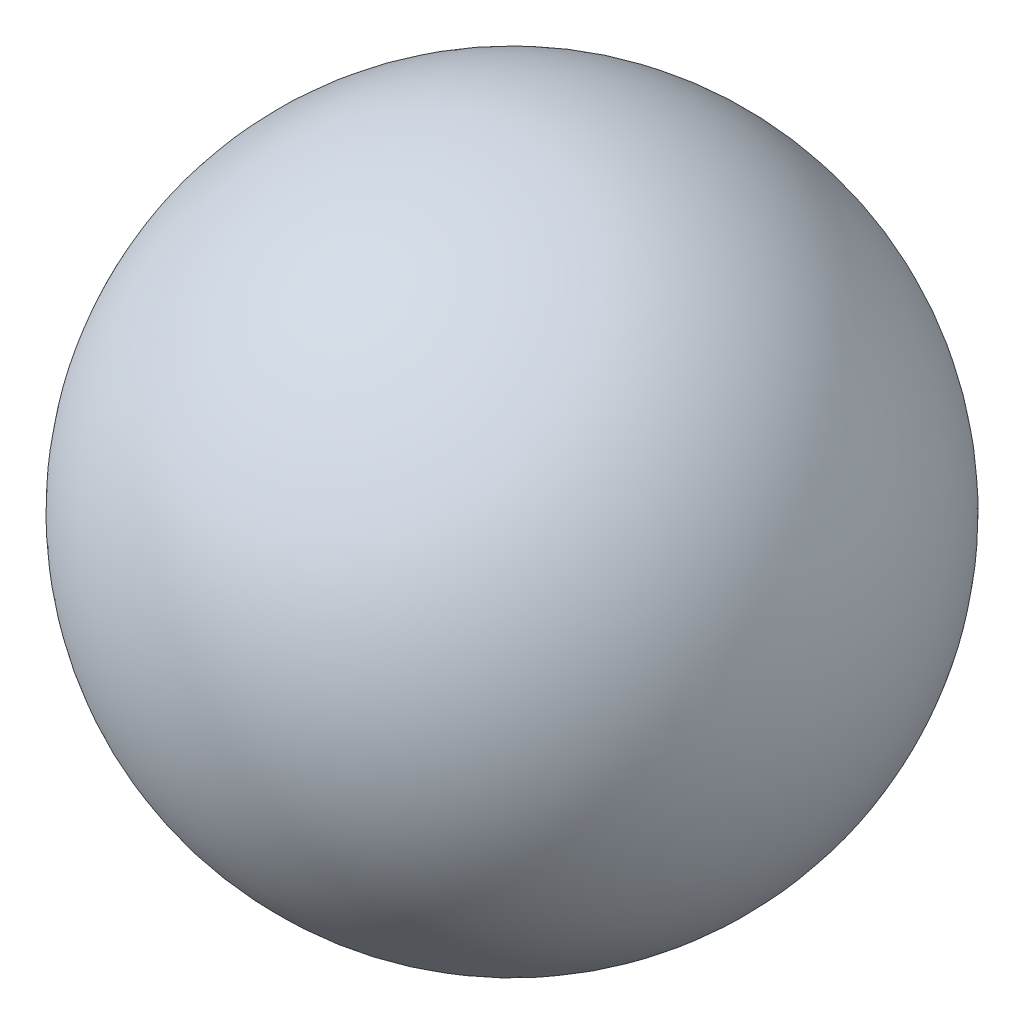
ISO-10303-21;
HEADER;
FILE_DESCRIPTION(('STEP AP214'),'2;1');
FILE_NAME('part.step','',(''),(''),'','','');
FILE_SCHEMA(('AUTOMOTIVE_DESIGN { 1 0 10303 214 1 1 1 1 }'));
ENDSEC;
DATA;
#1=APPLICATION_CONTEXT('core data for automotive mechanical design processes');
#2=APPLICATION_PROTOCOL_DEFINITION('international standard','automotive_design',2000,#1);
#3=PRODUCT_CONTEXT('',#1,'mechanical');
#4=PRODUCT('Part','Part','',(#3));
#5=PRODUCT_RELATED_PRODUCT_CATEGORY('part','',(#4));
#6=PRODUCT_DEFINITION_FORMATION('','',#4);
#7=PRODUCT_DEFINITION_CONTEXT('part definition',#1,'design');
#8=PRODUCT_DEFINITION('design','',#6,#7);
#9=PRODUCT_DEFINITION_SHAPE('','',#8);
#10=(LENGTH_UNIT() NAMED_UNIT(*) SI_UNIT(.MILLI.,.METRE.));
#11=(NAMED_UNIT(*) PLANE_ANGLE_UNIT() SI_UNIT($,.RADIAN.));
#12=(NAMED_UNIT(*) SI_UNIT($,.STERADIAN.) SOLID_ANGLE_UNIT());
#13=UNCERTAINTY_MEASURE_WITH_UNIT(LENGTH_MEASURE(1.E-05),#10,'distance_accuracy_value','');
#14=(GEOMETRIC_REPRESENTATION_CONTEXT(3) GLOBAL_UNCERTAINTY_ASSIGNED_CONTEXT((#13)) GLOBAL_UNIT_ASSIGNED_CONTEXT((#10,
#11,#12)) REPRESENTATION_CONTEXT('',''));
#15=CARTESIAN_POINT('',(0.,0.,0.));
#16=DIRECTION('',(0.,0.,1.));
#17=DIRECTION('',(1.,0.,0.));
#18=AXIS2_PLACEMENT_3D('',#15,#16,#17);
#19=CARTESIAN_POINT('',(0.,0.,0.));
#20=DIRECTION('',(-1.,0.,0.));
#21=DIRECTION('',(0.,0.,-1.));
#22=AXIS2_PLACEMENT_3D('',#19,#20,#21);
#23=SPHERICAL_SURFACE('',#22,63.5);
#24=CARTESIAN_POINT('',(-63.5,0.,0.));
#25=VERTEX_POINT('',#24);
#26=VERTEX_LOOP('',#25);
#27=FACE_BOUND('',#26,.T.);
#28=ADVANCED_FACE('F28',(#27),#23,.T.);
#29=CLOSED_SHELL('',(#28));
#30=MANIFOLD_SOLID_BREP('B2',#29);
#31=ADVANCED_BREP_SHAPE_REPRESENTATION('',(#18,#30),#14);
#32=SHAPE_DEFINITION_REPRESENTATION(#9,#31);
ENDSEC;
END-ISO-10303-21;
